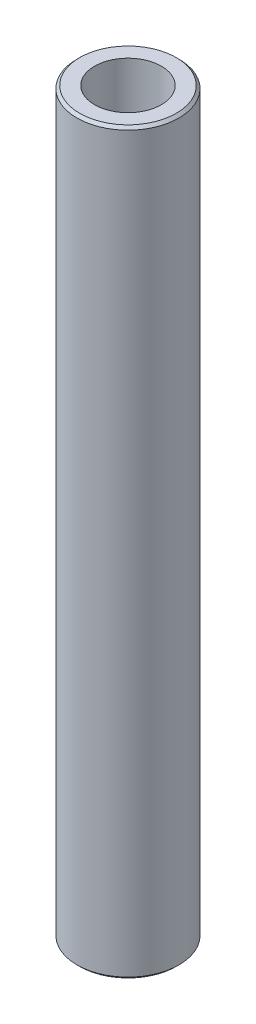
ISO-10303-21;
HEADER;
FILE_DESCRIPTION(('STEP AP214'),'2;1');
FILE_NAME('part.step','',(''),(''),'','','');
FILE_SCHEMA(('AUTOMOTIVE_DESIGN { 1 0 10303 214 1 1 1 1 }'));
ENDSEC;
DATA;
#1=APPLICATION_CONTEXT('core data for automotive mechanical design processes');
#2=APPLICATION_PROTOCOL_DEFINITION('international standard','automotive_design',2000,#1);
#3=PRODUCT_CONTEXT('',#1,'mechanical');
#4=PRODUCT('Part','Part','',(#3));
#5=PRODUCT_RELATED_PRODUCT_CATEGORY('part','',(#4));
#6=PRODUCT_DEFINITION_FORMATION('','',#4);
#7=PRODUCT_DEFINITION_CONTEXT('part definition',#1,'design');
#8=PRODUCT_DEFINITION('design','',#6,#7);
#9=PRODUCT_DEFINITION_SHAPE('','',#8);
#10=(LENGTH_UNIT() NAMED_UNIT(*) SI_UNIT(.MILLI.,.METRE.));
#11=(NAMED_UNIT(*) PLANE_ANGLE_UNIT() SI_UNIT($,.RADIAN.));
#12=(NAMED_UNIT(*) SI_UNIT($,.STERADIAN.) SOLID_ANGLE_UNIT());
#13=UNCERTAINTY_MEASURE_WITH_UNIT(LENGTH_MEASURE(1.E-05),#10,'distance_accuracy_value','');
#14=(GEOMETRIC_REPRESENTATION_CONTEXT(3) GLOBAL_UNCERTAINTY_ASSIGNED_CONTEXT((#13)) GLOBAL_UNIT_ASSIGNED_CONTEXT((#10,
#11,#12)) REPRESENTATION_CONTEXT('',''));
#15=CARTESIAN_POINT('',(0.,0.,0.));
#16=DIRECTION('',(0.,0.,1.));
#17=DIRECTION('',(1.,0.,0.));
#18=AXIS2_PLACEMENT_3D('',#15,#16,#17);
#19=CARTESIAN_POINT('',(0.,217.322162524497,0.));
#20=DIRECTION('',(0.,-1.,0.));
#21=DIRECTION('',(0.,0.,-1.));
#22=AXIS2_PLACEMENT_3D('',#19,#20,#21);
#23=CYLINDRICAL_SURFACE('',#22,15.);
#24=CARTESIAN_POINT('',(0.,216.519865686077,0.));
#25=DIRECTION('',(0.,1.,0.));
#26=DIRECTION('',(0.,0.,1.));
#27=AXIS2_PLACEMENT_3D('',#24,#25,#26);
#28=CIRCLE('',#27,15.);
#29=CARTESIAN_POINT('',(0.,216.519865686077,15.));
#30=VERTEX_POINT('',#29);
#31=EDGE_CURVE('E50',#30,#30,#28,.F.);
#32=ORIENTED_EDGE('',*,*,#31,.T.);
#33=EDGE_LOOP('',(#32));
#34=FACE_BOUND('',#33,.T.);
#35=CARTESIAN_POINT('',(0.,0.794101076371873,0.));
#36=DIRECTION('',(0.,1.,0.));
#37=DIRECTION('',(0.,0.,1.));
#38=AXIS2_PLACEMENT_3D('',#35,#36,#37);
#39=CIRCLE('',#38,15.);
#40=CARTESIAN_POINT('',(0.,0.794101076371873,15.));
#41=VERTEX_POINT('',#40);
#42=EDGE_CURVE('E51',#41,#41,#39,.T.);
#43=ORIENTED_EDGE('',*,*,#42,.T.);
#44=EDGE_LOOP('',(#43));
#45=FACE_BOUND('',#44,.T.);
#46=ADVANCED_FACE('F39',(#34,#45),#23,.T.);
#47=CARTESIAN_POINT('',(0.,217.322162524497,0.));
#48=DIRECTION('',(0.,1.,0.));
#49=DIRECTION('',(0.,0.,1.));
#50=AXIS2_PLACEMENT_3D('',#47,#48,#49);
#51=PLANE('',#50);
#52=CARTESIAN_POINT('',(0.,217.322162524497,0.));
#53=DIRECTION('',(0.,1.,0.));
#54=DIRECTION('',(0.,0.,1.));
#55=AXIS2_PLACEMENT_3D('',#52,#53,#54);
#56=CIRCLE('',#55,14.2058989236281);
#57=CARTESIAN_POINT('',(0.,217.322162524497,14.2058989236281));
#58=VERTEX_POINT('',#57);
#59=EDGE_CURVE('E54',#58,#58,#56,.T.);
#60=ORIENTED_EDGE('',*,*,#59,.T.);
#61=EDGE_LOOP('',(#60));
#62=FACE_BOUND('',#61,.T.);
#63=CARTESIAN_POINT('',(0.,217.322162524497,0.));
#64=DIRECTION('',(0.,1.,0.));
#65=DIRECTION('',(0.,0.,1.));
#66=AXIS2_PLACEMENT_3D('',#63,#64,#65);
#67=CIRCLE('',#66,9.82967930526576);
#68=CARTESIAN_POINT('',(0.,217.322162524497,9.82967930526576));
#69=VERTEX_POINT('',#68);
#70=EDGE_CURVE('E58',#69,#69,#67,.T.);
#71=ORIENTED_EDGE('',*,*,#70,.F.);
#72=EDGE_LOOP('',(#71));
#73=FACE_BOUND('',#72,.T.);
#74=ADVANCED_FACE('F69',(#62,#73),#51,.T.);
#75=CARTESIAN_POINT('',(0.,0.,0.));
#76=DIRECTION('',(0.,1.,0.));
#77=DIRECTION('',(0.,0.,1.));
#78=AXIS2_PLACEMENT_3D('',#75,#76,#77);
#79=PLANE('',#78);
#80=CARTESIAN_POINT('',(0.,0.,0.));
#81=DIRECTION('',(0.,1.,0.));
#82=DIRECTION('',(0.,0.,1.));
#83=AXIS2_PLACEMENT_3D('',#80,#81,#82);
#84=CIRCLE('',#83,14.1977031615794);
#85=CARTESIAN_POINT('',(0.,0.,14.1977031615794));
#86=VERTEX_POINT('',#85);
#87=EDGE_CURVE('E10',#86,#86,#84,.F.);
#88=ORIENTED_EDGE('',*,*,#87,.T.);
#89=EDGE_LOOP('',(#88));
#90=FACE_BOUND('',#89,.T.);
#91=CARTESIAN_POINT('',(0.,0.,0.));
#92=DIRECTION('',(0.,1.,0.));
#93=DIRECTION('',(0.,0.,1.));
#94=AXIS2_PLACEMENT_3D('',#91,#92,#93);
#95=CIRCLE('',#94,9.82967930526576);
#96=CARTESIAN_POINT('',(0.,0.,9.82967930526576));
#97=VERTEX_POINT('',#96);
#98=EDGE_CURVE('E63',#97,#97,#95,.T.);
#99=ORIENTED_EDGE('',*,*,#98,.T.);
#100=EDGE_LOOP('',(#99));
#101=FACE_BOUND('',#100,.T.);
#102=ADVANCED_FACE('F75',(#90,#101),#79,.F.);
#103=CARTESIAN_POINT('',(0.,217.322162524497,0.));
#104=DIRECTION('',(0.,-1.,0.));
#105=DIRECTION('',(0.,0.,-1.));
#106=AXIS2_PLACEMENT_3D('',#103,#104,#105);
#107=CYLINDRICAL_SURFACE('',#106,9.82967930526576);
#108=ORIENTED_EDGE('',*,*,#70,.T.);
#109=EDGE_LOOP('',(#108));
#110=FACE_BOUND('',#109,.T.);
#111=ORIENTED_EDGE('',*,*,#98,.F.);
#112=EDGE_LOOP('',(#111));
#113=FACE_BOUND('',#112,.T.);
#114=ADVANCED_FACE('F70',(#110,#113),#107,.F.);
#115=CARTESIAN_POINT('',(0.,217.322162524497,0.));
#116=DIRECTION('',(0.,-1.,0.));
#117=DIRECTION('',(0.,0.,-1.));
#118=AXIS2_PLACEMENT_3D('',#115,#116,#117);
#119=CONICAL_SURFACE('',#118,14.2058989236281,0.780264299234492);
#120=ORIENTED_EDGE('',*,*,#31,.F.);
#121=EDGE_LOOP('',(#120));
#122=FACE_BOUND('',#121,.T.);
#123=ORIENTED_EDGE('',*,*,#59,.F.);
#124=EDGE_LOOP('',(#123));
#125=FACE_BOUND('',#124,.T.);
#126=ADVANCED_FACE('F81',(#122,#125),#119,.T.);
#127=CARTESIAN_POINT('',(0.,0.794101076371873,0.));
#128=DIRECTION('',(0.,1.,0.));
#129=DIRECTION('',(0.,0.,1.));
#130=AXIS2_PLACEMENT_3D('',#127,#128,#129);
#131=CONICAL_SURFACE('',#130,15.,0.790532027560404);
#132=ORIENTED_EDGE('',*,*,#87,.F.);
#133=EDGE_LOOP('',(#132));
#134=FACE_BOUND('',#133,.T.);
#135=ORIENTED_EDGE('',*,*,#42,.F.);
#136=EDGE_LOOP('',(#135));
#137=FACE_BOUND('',#136,.T.);
#138=ADVANCED_FACE('F45',(#134,#137),#131,.T.);
#139=CLOSED_SHELL('',(#46,#74,#102,#114,#126,#138));
#140=MANIFOLD_SOLID_BREP('B2',#139);
#141=ADVANCED_BREP_SHAPE_REPRESENTATION('',(#18,#140),#14);
#142=SHAPE_DEFINITION_REPRESENTATION(#9,#141);
ENDSEC;
END-ISO-10303-21;
